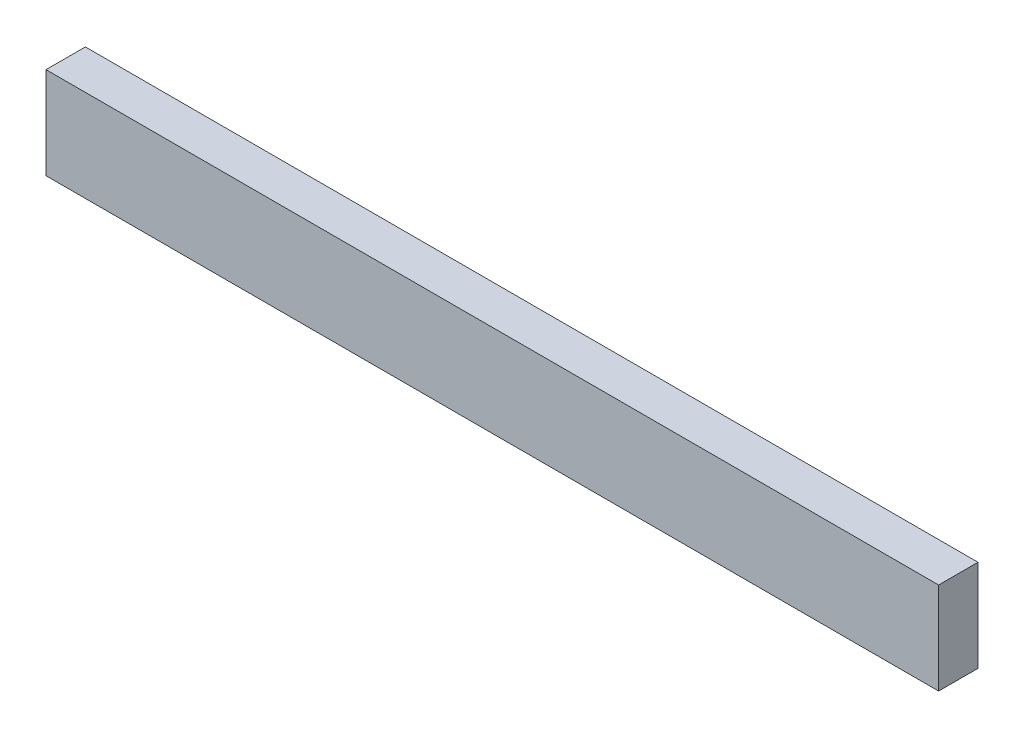
ISO-10303-21;
HEADER;
FILE_DESCRIPTION(('STEP AP214'),'2;1');
FILE_NAME('part.step','',(''),(''),'','','');
FILE_SCHEMA(('AUTOMOTIVE_DESIGN { 1 0 10303 214 1 1 1 1 }'));
ENDSEC;
DATA;
#1=APPLICATION_CONTEXT('core data for automotive mechanical design processes');
#2=APPLICATION_PROTOCOL_DEFINITION('international standard','automotive_design',2000,#1);
#3=PRODUCT_CONTEXT('',#1,'mechanical');
#4=PRODUCT('Part','Part','',(#3));
#5=PRODUCT_RELATED_PRODUCT_CATEGORY('part','',(#4));
#6=PRODUCT_DEFINITION_FORMATION('','',#4);
#7=PRODUCT_DEFINITION_CONTEXT('part definition',#1,'design');
#8=PRODUCT_DEFINITION('design','',#6,#7);
#9=PRODUCT_DEFINITION_SHAPE('','',#8);
#10=(LENGTH_UNIT() NAMED_UNIT(*) SI_UNIT(.MILLI.,.METRE.));
#11=(NAMED_UNIT(*) PLANE_ANGLE_UNIT() SI_UNIT($,.RADIAN.));
#12=(NAMED_UNIT(*) SI_UNIT($,.STERADIAN.) SOLID_ANGLE_UNIT());
#13=UNCERTAINTY_MEASURE_WITH_UNIT(LENGTH_MEASURE(1.E-05),#10,'distance_accuracy_value','');
#14=(GEOMETRIC_REPRESENTATION_CONTEXT(3) GLOBAL_UNCERTAINTY_ASSIGNED_CONTEXT((#13)) GLOBAL_UNIT_ASSIGNED_CONTEXT((#10,
#11,#12)) REPRESENTATION_CONTEXT('',''));
#15=CARTESIAN_POINT('',(0.,0.,0.));
#16=DIRECTION('',(0.,0.,1.));
#17=DIRECTION('',(1.,0.,0.));
#18=AXIS2_PLACEMENT_3D('',#15,#16,#17);
#19=CARTESIAN_POINT('',(-431.8,-44.45,-19.05));
#20=DIRECTION('',(0.,0.,-1.));
#21=DIRECTION('',(-1.,0.,0.));
#22=AXIS2_PLACEMENT_3D('',#19,#20,#21);
#23=PLANE('',#22);
#24=DIRECTION('',(1.,0.,0.));
#25=VECTOR('',#24,1.);
#26=CARTESIAN_POINT('',(-431.8,44.45,-19.05));
#27=LINE('',#26,#25);
#28=CARTESIAN_POINT('',(-431.8,44.45,-19.05));
#29=VERTEX_POINT('',#28);
#30=CARTESIAN_POINT('',(431.8,44.45,-19.05));
#31=VERTEX_POINT('',#30);
#32=EDGE_CURVE('E35',#29,#31,#27,.T.);
#33=ORIENTED_EDGE('',*,*,#32,.T.);
#34=DIRECTION('',(0.,1.,0.));
#35=VECTOR('',#34,1.);
#36=CARTESIAN_POINT('',(431.8,-44.45,-19.05));
#37=LINE('',#36,#35);
#38=CARTESIAN_POINT('',(431.8,-44.45,-19.05));
#39=VERTEX_POINT('',#38);
#40=EDGE_CURVE('E72',#39,#31,#37,.T.);
#41=ORIENTED_EDGE('',*,*,#40,.F.);
#42=DIRECTION('',(1.,0.,0.));
#43=VECTOR('',#42,1.);
#44=CARTESIAN_POINT('',(-431.8,-44.45,-19.05));
#45=LINE('',#44,#43);
#46=CARTESIAN_POINT('',(-431.8,-44.45,-19.05));
#47=VERTEX_POINT('',#46);
#48=EDGE_CURVE('E11',#47,#39,#45,.T.);
#49=ORIENTED_EDGE('',*,*,#48,.F.);
#50=DIRECTION('',(0.,1.,0.));
#51=VECTOR('',#50,1.);
#52=CARTESIAN_POINT('',(-431.8,-44.45,-19.05));
#53=LINE('',#52,#51);
#54=EDGE_CURVE('E73',#47,#29,#53,.T.);
#55=ORIENTED_EDGE('',*,*,#54,.T.);
#56=EDGE_LOOP('',(#33,#41,#49,#55));
#57=FACE_BOUND('',#56,.T.);
#58=ADVANCED_FACE('F32',(#57),#23,.T.);
#59=CARTESIAN_POINT('',(-431.8,-44.45,19.05));
#60=DIRECTION('',(0.,-1.,0.));
#61=DIRECTION('',(0.,0.,-1.));
#62=AXIS2_PLACEMENT_3D('',#59,#60,#61);
#63=PLANE('',#62);
#64=ORIENTED_EDGE('',*,*,#48,.T.);
#65=DIRECTION('',(0.,0.,-1.));
#66=VECTOR('',#65,1.);
#67=CARTESIAN_POINT('',(431.8,-44.45,19.05));
#68=LINE('',#67,#66);
#69=CARTESIAN_POINT('',(431.8,-44.45,19.05));
#70=VERTEX_POINT('',#69);
#71=EDGE_CURVE('E89',#70,#39,#68,.T.);
#72=ORIENTED_EDGE('',*,*,#71,.F.);
#73=DIRECTION('',(1.,0.,0.));
#74=VECTOR('',#73,1.);
#75=CARTESIAN_POINT('',(-431.8,-44.45,19.05));
#76=LINE('',#75,#74);
#77=CARTESIAN_POINT('',(-431.8,-44.45,19.05));
#78=VERTEX_POINT('',#77);
#79=EDGE_CURVE('E40',#78,#70,#76,.T.);
#80=ORIENTED_EDGE('',*,*,#79,.F.);
#81=DIRECTION('',(0.,0.,-1.));
#82=VECTOR('',#81,1.);
#83=CARTESIAN_POINT('',(-431.8,-44.45,19.05));
#84=LINE('',#83,#82);
#85=EDGE_CURVE('E78',#78,#47,#84,.T.);
#86=ORIENTED_EDGE('',*,*,#85,.T.);
#87=EDGE_LOOP('',(#64,#72,#80,#86));
#88=FACE_BOUND('',#87,.T.);
#89=ADVANCED_FACE('F104',(#88),#63,.T.);
#90=CARTESIAN_POINT('',(-431.8,-44.45,19.05));
#91=DIRECTION('',(0.,0.,1.));
#92=DIRECTION('',(1.,0.,0.));
#93=AXIS2_PLACEMENT_3D('',#90,#91,#92);
#94=PLANE('',#93);
#95=ORIENTED_EDGE('',*,*,#79,.T.);
#96=DIRECTION('',(0.,-1.,0.));
#97=VECTOR('',#96,1.);
#98=CARTESIAN_POINT('',(431.8,-44.45,19.05));
#99=LINE('',#98,#97);
#100=CARTESIAN_POINT('',(431.8,44.45,19.05));
#101=VERTEX_POINT('',#100);
#102=EDGE_CURVE('E85',#101,#70,#99,.T.);
#103=ORIENTED_EDGE('',*,*,#102,.F.);
#104=DIRECTION('',(1.,0.,0.));
#105=VECTOR('',#104,1.);
#106=CARTESIAN_POINT('',(-431.8,44.45,19.05));
#107=LINE('',#106,#105);
#108=CARTESIAN_POINT('',(-431.8,44.45,19.05));
#109=VERTEX_POINT('',#108);
#110=EDGE_CURVE('E77',#109,#101,#107,.T.);
#111=ORIENTED_EDGE('',*,*,#110,.F.);
#112=DIRECTION('',(0.,-1.,0.));
#113=VECTOR('',#112,1.);
#114=CARTESIAN_POINT('',(-431.8,-44.45,19.05));
#115=LINE('',#114,#113);
#116=EDGE_CURVE('E97',#109,#78,#115,.T.);
#117=ORIENTED_EDGE('',*,*,#116,.T.);
#118=EDGE_LOOP('',(#95,#103,#111,#117));
#119=FACE_BOUND('',#118,.T.);
#120=ADVANCED_FACE('F101',(#119),#94,.T.);
#121=CARTESIAN_POINT('',(-431.8,44.45,19.05));
#122=DIRECTION('',(0.,1.,0.));
#123=DIRECTION('',(0.,0.,1.));
#124=AXIS2_PLACEMENT_3D('',#121,#122,#123);
#125=PLANE('',#124);
#126=ORIENTED_EDGE('',*,*,#110,.T.);
#127=DIRECTION('',(0.,0.,1.));
#128=VECTOR('',#127,1.);
#129=CARTESIAN_POINT('',(431.8,44.45,19.05));
#130=LINE('',#129,#128);
#131=EDGE_CURVE('E80',#31,#101,#130,.T.);
#132=ORIENTED_EDGE('',*,*,#131,.F.);
#133=ORIENTED_EDGE('',*,*,#32,.F.);
#134=DIRECTION('',(0.,0.,1.));
#135=VECTOR('',#134,1.);
#136=CARTESIAN_POINT('',(-431.8,44.45,19.05));
#137=LINE('',#136,#135);
#138=EDGE_CURVE('E95',#29,#109,#137,.T.);
#139=ORIENTED_EDGE('',*,*,#138,.T.);
#140=EDGE_LOOP('',(#126,#132,#133,#139));
#141=FACE_BOUND('',#140,.T.);
#142=ADVANCED_FACE('F81',(#141),#125,.T.);
#143=CARTESIAN_POINT('',(-431.8,0.,0.));
#144=DIRECTION('',(-1.,0.,0.));
#145=DIRECTION('',(0.,0.,1.));
#146=AXIS2_PLACEMENT_3D('',#143,#144,#145);
#147=PLANE('',#146);
#148=ORIENTED_EDGE('',*,*,#54,.F.);
#149=ORIENTED_EDGE('',*,*,#85,.F.);
#150=ORIENTED_EDGE('',*,*,#116,.F.);
#151=ORIENTED_EDGE('',*,*,#138,.F.);
#152=EDGE_LOOP('',(#148,#149,#150,#151));
#153=FACE_BOUND('',#152,.T.);
#154=ADVANCED_FACE('F106',(#153),#147,.T.);
#155=CARTESIAN_POINT('',(431.8,0.,0.));
#156=DIRECTION('',(-1.,0.,0.));
#157=DIRECTION('',(0.,0.,1.));
#158=AXIS2_PLACEMENT_3D('',#155,#156,#157);
#159=PLANE('',#158);
#160=ORIENTED_EDGE('',*,*,#40,.T.);
#161=ORIENTED_EDGE('',*,*,#131,.T.);
#162=ORIENTED_EDGE('',*,*,#102,.T.);
#163=ORIENTED_EDGE('',*,*,#71,.T.);
#164=EDGE_LOOP('',(#160,#161,#162,#163));
#165=FACE_BOUND('',#164,.T.);
#166=ADVANCED_FACE('F88',(#165),#159,.F.);
#167=CLOSED_SHELL('',(#58,#89,#120,#142,#154,#166));
#168=MANIFOLD_SOLID_BREP('B2',#167);
#169=ADVANCED_BREP_SHAPE_REPRESENTATION('',(#18,#168),#14);
#170=SHAPE_DEFINITION_REPRESENTATION(#9,#169);
ENDSEC;
END-ISO-10303-21;
